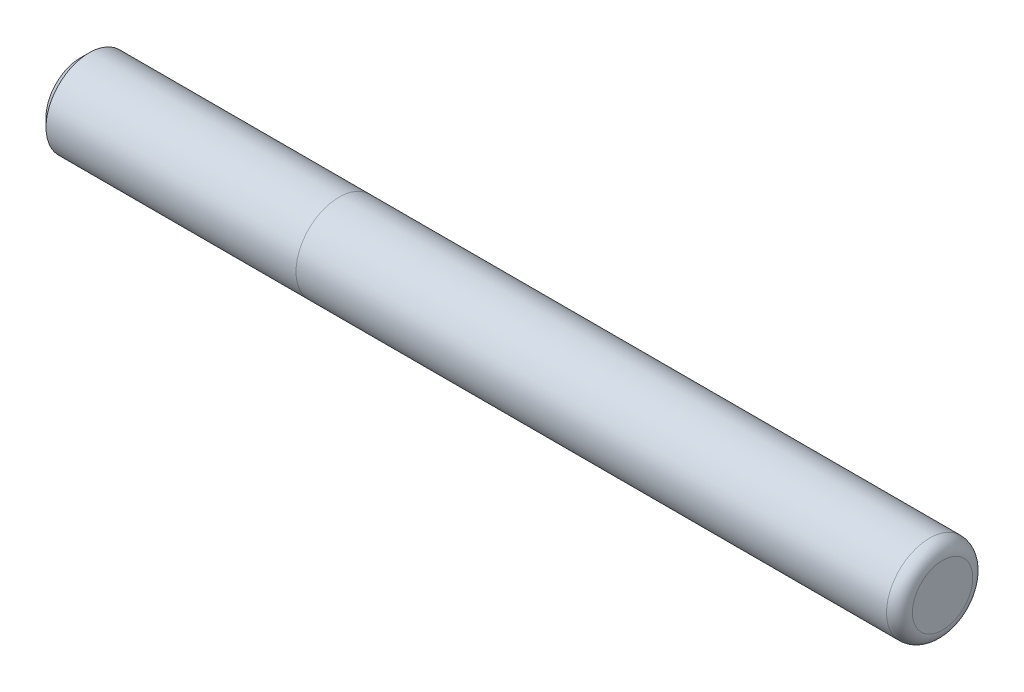
ISO-10303-21;
HEADER;
FILE_DESCRIPTION(('STEP AP214'),'2;1');
FILE_NAME('part.step','',(''),(''),'','','');
FILE_SCHEMA(('AUTOMOTIVE_DESIGN { 1 0 10303 214 1 1 1 1 }'));
ENDSEC;
DATA;
#1=APPLICATION_CONTEXT('core data for automotive mechanical design processes');
#2=APPLICATION_PROTOCOL_DEFINITION('international standard','automotive_design',2000,#1);
#3=PRODUCT_CONTEXT('',#1,'mechanical');
#4=PRODUCT('Part','Part','',(#3));
#5=PRODUCT_RELATED_PRODUCT_CATEGORY('part','',(#4));
#6=PRODUCT_DEFINITION_FORMATION('','',#4);
#7=PRODUCT_DEFINITION_CONTEXT('part definition',#1,'design');
#8=PRODUCT_DEFINITION('design','',#6,#7);
#9=PRODUCT_DEFINITION_SHAPE('','',#8);
#10=(LENGTH_UNIT() NAMED_UNIT(*) SI_UNIT(.MILLI.,.METRE.));
#11=(NAMED_UNIT(*) PLANE_ANGLE_UNIT() SI_UNIT($,.RADIAN.));
#12=(NAMED_UNIT(*) SI_UNIT($,.STERADIAN.) SOLID_ANGLE_UNIT());
#13=UNCERTAINTY_MEASURE_WITH_UNIT(LENGTH_MEASURE(1.E-05),#10,'distance_accuracy_value','');
#14=(GEOMETRIC_REPRESENTATION_CONTEXT(3) GLOBAL_UNCERTAINTY_ASSIGNED_CONTEXT((#13)) GLOBAL_UNIT_ASSIGNED_CONTEXT((#10,
#11,#12)) REPRESENTATION_CONTEXT('',''));
#15=CARTESIAN_POINT('',(0.,0.,0.));
#16=DIRECTION('',(0.,0.,1.));
#17=DIRECTION('',(1.,0.,0.));
#18=AXIS2_PLACEMENT_3D('',#15,#16,#17);
#19=CARTESIAN_POINT('',(0.,0.,0.));
#20=DIRECTION('',(-1.,0.,0.));
#21=DIRECTION('',(0.,0.,1.));
#22=AXIS2_PLACEMENT_3D('',#19,#20,#21);
#23=PLANE('',#22);
#24=CARTESIAN_POINT('',(0.,0.,0.));
#25=DIRECTION('',(-1.,0.,0.));
#26=DIRECTION('',(0.,0.,1.));
#27=AXIS2_PLACEMENT_3D('',#24,#25,#26);
#28=CIRCLE('',#27,3.5);
#29=CARTESIAN_POINT('',(0.,0.,3.5));
#30=VERTEX_POINT('',#29);
#31=EDGE_CURVE('E10',#30,#30,#28,.T.);
#32=ORIENTED_EDGE('',*,*,#31,.F.);
#33=EDGE_LOOP('',(#32));
#34=FACE_BOUND('',#33,.T.);
#35=ADVANCED_FACE('F35',(#34),#23,.F.);
#36=CARTESIAN_POINT('',(-1.5,0.,0.));
#37=DIRECTION('',(-1.,0.,0.));
#38=DIRECTION('',(0.,0.,1.));
#39=AXIS2_PLACEMENT_3D('',#36,#37,#38);
#40=TOROIDAL_SURFACE('',#39,3.5,1.5);
#41=CARTESIAN_POINT('',(-1.5,0.,0.));
#42=DIRECTION('',(-1.,0.,0.));
#43=DIRECTION('',(0.,0.,1.));
#44=AXIS2_PLACEMENT_3D('',#41,#42,#43);
#45=CIRCLE('',#44,5.);
#46=CARTESIAN_POINT('',(-1.5,0.,5.));
#47=VERTEX_POINT('',#46);
#48=EDGE_CURVE('E41',#47,#47,#45,.T.);
#49=ORIENTED_EDGE('',*,*,#48,.F.);
#50=EDGE_LOOP('',(#49));
#51=FACE_BOUND('',#50,.T.);
#52=ORIENTED_EDGE('',*,*,#31,.T.);
#53=EDGE_LOOP('',(#52));
#54=FACE_BOUND('',#53,.T.);
#55=ADVANCED_FACE('F83',(#51,#54),#40,.T.);
#56=CARTESIAN_POINT('',(-100.,0.,0.));
#57=DIRECTION('',(-1.,0.,0.));
#58=DIRECTION('',(0.,0.,1.));
#59=AXIS2_PLACEMENT_3D('',#56,#57,#58);
#60=CYLINDRICAL_SURFACE('',#59,5.);
#61=CARTESIAN_POINT('',(-70.,0.,0.));
#62=DIRECTION('',(-1.,0.,0.));
#63=DIRECTION('',(0.,0.,1.));
#64=AXIS2_PLACEMENT_3D('',#61,#62,#63);
#65=CIRCLE('',#64,4.99999999999999);
#66=CARTESIAN_POINT('',(-70.,0.,4.99999999999999));
#67=VERTEX_POINT('',#66);
#68=EDGE_CURVE('E45',#67,#67,#65,.T.);
#69=ORIENTED_EDGE('',*,*,#68,.F.);
#70=EDGE_LOOP('',(#69));
#71=FACE_BOUND('',#70,.T.);
#72=ORIENTED_EDGE('',*,*,#48,.T.);
#73=EDGE_LOOP('',(#72));
#74=FACE_BOUND('',#73,.T.);
#75=ADVANCED_FACE('F78',(#71,#74),#60,.T.);
#76=CARTESIAN_POINT('',(-70.,0.,0.));
#77=DIRECTION('',(1.,0.,0.));
#78=DIRECTION('',(0.,0.,-1.));
#79=AXIS2_PLACEMENT_3D('',#76,#77,#78);
#80=PLANE('',#79);
#81=CARTESIAN_POINT('',(-70.,0.,0.));
#82=DIRECTION('',(-1.,0.,0.));
#83=DIRECTION('',(0.,0.,1.));
#84=AXIS2_PLACEMENT_3D('',#81,#82,#83);
#85=CIRCLE('',#84,4.999);
#86=CARTESIAN_POINT('',(-70.,0.,4.999));
#87=VERTEX_POINT('',#86);
#88=EDGE_CURVE('E49',#87,#87,#85,.T.);
#89=ORIENTED_EDGE('',*,*,#88,.F.);
#90=EDGE_LOOP('',(#89));
#91=FACE_BOUND('',#90,.T.);
#92=ORIENTED_EDGE('',*,*,#68,.T.);
#93=EDGE_LOOP('',(#92));
#94=FACE_BOUND('',#93,.T.);
#95=ADVANCED_FACE('F72',(#91,#94),#80,.F.);
#96=CARTESIAN_POINT('',(-100.,0.,0.));
#97=DIRECTION('',(-1.,0.,0.));
#98=DIRECTION('',(0.,0.,1.));
#99=AXIS2_PLACEMENT_3D('',#96,#97,#98);
#100=CYLINDRICAL_SURFACE('',#99,4.999);
#101=CARTESIAN_POINT('',(-99.,0.,0.));
#102=DIRECTION('',(-1.,0.,0.));
#103=DIRECTION('',(0.,0.,1.));
#104=AXIS2_PLACEMENT_3D('',#101,#102,#103);
#105=CIRCLE('',#104,4.999);
#106=CARTESIAN_POINT('',(-99.,0.,4.999));
#107=VERTEX_POINT('',#106);
#108=EDGE_CURVE('E54',#107,#107,#105,.T.);
#109=ORIENTED_EDGE('',*,*,#108,.F.);
#110=EDGE_LOOP('',(#109));
#111=FACE_BOUND('',#110,.T.);
#112=ORIENTED_EDGE('',*,*,#88,.T.);
#113=EDGE_LOOP('',(#112));
#114=FACE_BOUND('',#113,.T.);
#115=ADVANCED_FACE('F66',(#111,#114),#100,.T.);
#116=CARTESIAN_POINT('',(-99.,0.,0.));
#117=DIRECTION('',(1.,0.,0.));
#118=DIRECTION('',(0.,0.,-1.));
#119=AXIS2_PLACEMENT_3D('',#116,#117,#118);
#120=CONICAL_SURFACE('',#119,4.999,0.785398163397448);
#121=CARTESIAN_POINT('',(-100.,0.,0.));
#122=DIRECTION('',(-1.,0.,0.));
#123=DIRECTION('',(0.,0.,1.));
#124=AXIS2_PLACEMENT_3D('',#121,#122,#123);
#125=CIRCLE('',#124,3.999);
#126=CARTESIAN_POINT('',(-100.,0.,3.999));
#127=VERTEX_POINT('',#126);
#128=EDGE_CURVE('E57',#127,#127,#125,.T.);
#129=ORIENTED_EDGE('',*,*,#128,.F.);
#130=EDGE_LOOP('',(#129));
#131=FACE_BOUND('',#130,.T.);
#132=ORIENTED_EDGE('',*,*,#108,.T.);
#133=EDGE_LOOP('',(#132));
#134=FACE_BOUND('',#133,.T.);
#135=ADVANCED_FACE('F63',(#131,#134),#120,.T.);
#136=CARTESIAN_POINT('',(-100.,0.,0.));
#137=DIRECTION('',(1.,0.,0.));
#138=DIRECTION('',(0.,0.,-1.));
#139=AXIS2_PLACEMENT_3D('',#136,#137,#138);
#140=PLANE('',#139);
#141=ORIENTED_EDGE('',*,*,#128,.T.);
#142=EDGE_LOOP('',(#141));
#143=FACE_BOUND('',#142,.T.);
#144=ADVANCED_FACE('F61',(#143),#140,.F.);
#145=CLOSED_SHELL('',(#35,#55,#75,#95,#115,#135,#144));
#146=MANIFOLD_SOLID_BREP('B2',#145);
#147=ADVANCED_BREP_SHAPE_REPRESENTATION('',(#18,#146),#14);
#148=SHAPE_DEFINITION_REPRESENTATION(#9,#147);
ENDSEC;
END-ISO-10303-21;
